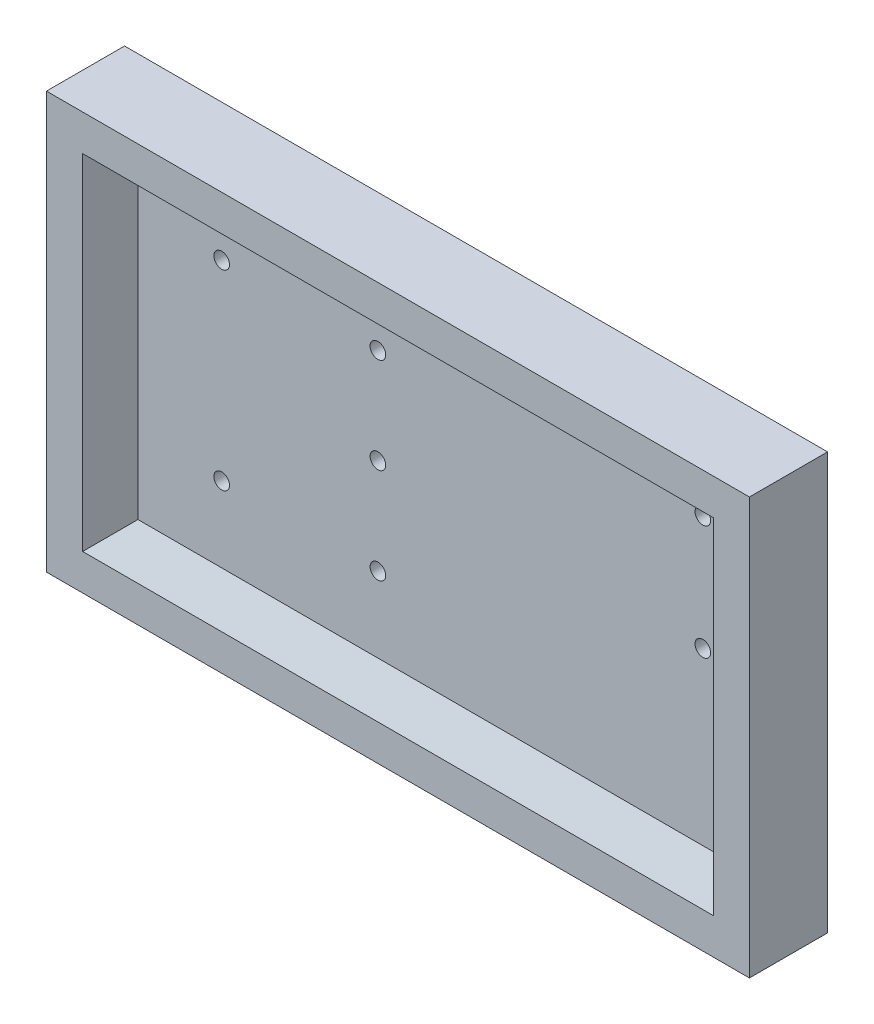
ISO-10303-21;
HEADER;
FILE_DESCRIPTION(('STEP AP214'),'2;1');
FILE_NAME('part.step','',(''),(''),'','','');
FILE_SCHEMA(('AUTOMOTIVE_DESIGN { 1 0 10303 214 1 1 1 1 }'));
ENDSEC;
DATA;
#1=APPLICATION_CONTEXT('core data for automotive mechanical design processes');
#2=APPLICATION_PROTOCOL_DEFINITION('international standard','automotive_design',2000,#1);
#3=PRODUCT_CONTEXT('',#1,'mechanical');
#4=PRODUCT('Part','Part','',(#3));
#5=PRODUCT_RELATED_PRODUCT_CATEGORY('part','',(#4));
#6=PRODUCT_DEFINITION_FORMATION('','',#4);
#7=PRODUCT_DEFINITION_CONTEXT('part definition',#1,'design');
#8=PRODUCT_DEFINITION('design','',#6,#7);
#9=PRODUCT_DEFINITION_SHAPE('','',#8);
#10=(LENGTH_UNIT() NAMED_UNIT(*) SI_UNIT(.MILLI.,.METRE.));
#11=(NAMED_UNIT(*) PLANE_ANGLE_UNIT() SI_UNIT($,.RADIAN.));
#12=(NAMED_UNIT(*) SI_UNIT($,.STERADIAN.) SOLID_ANGLE_UNIT());
#13=UNCERTAINTY_MEASURE_WITH_UNIT(LENGTH_MEASURE(1.E-05),#10,'distance_accuracy_value','');
#14=(GEOMETRIC_REPRESENTATION_CONTEXT(3) GLOBAL_UNCERTAINTY_ASSIGNED_CONTEXT((#13)) GLOBAL_UNIT_ASSIGNED_CONTEXT((#10,
#11,#12)) REPRESENTATION_CONTEXT('',''));
#15=CARTESIAN_POINT('',(0.,0.,0.));
#16=DIRECTION('',(0.,0.,1.));
#17=DIRECTION('',(1.,0.,0.));
#18=AXIS2_PLACEMENT_3D('',#15,#16,#17);
#19=CARTESIAN_POINT('',(53.3,40.,-30.));
#20=DIRECTION('',(0.,0.,-1.));
#21=DIRECTION('',(-1.,0.,0.));
#22=AXIS2_PLACEMENT_3D('',#19,#20,#21);
#23=CYLINDRICAL_SURFACE('',#22,1.5);
#24=CARTESIAN_POINT('',(53.3,40.,-40.));
#25=DIRECTION('',(0.,0.,-1.));
#26=DIRECTION('',(-1.,0.,0.));
#27=AXIS2_PLACEMENT_3D('',#24,#25,#26);
#28=CIRCLE('',#27,1.5);
#29=CARTESIAN_POINT('',(51.8,40.,-40.));
#30=VERTEX_POINT('',#29);
#31=EDGE_CURVE('E180',#30,#30,#28,.T.);
#32=ORIENTED_EDGE('',*,*,#31,.T.);
#33=EDGE_LOOP('',(#32));
#34=FACE_BOUND('',#33,.T.);
#35=CARTESIAN_POINT('',(53.3,40.,-35.35));
#36=DIRECTION('',(0.,0.,1.));
#37=DIRECTION('',(1.,0.,0.));
#38=AXIS2_PLACEMENT_3D('',#35,#36,#37);
#39=CIRCLE('',#38,1.5);
#40=CARTESIAN_POINT('',(54.8,40.,-35.35));
#41=VERTEX_POINT('',#40);
#42=EDGE_CURVE('E173',#41,#41,#39,.F.);
#43=ORIENTED_EDGE('',*,*,#42,.F.);
#44=EDGE_LOOP('',(#43));
#45=FACE_BOUND('',#44,.T.);
#46=ADVANCED_FACE('F33',(#34,#45),#23,.F.);
#47=CARTESIAN_POINT('',(53.3,58.35,-30.));
#48=DIRECTION('',(0.,0.,-1.));
#49=DIRECTION('',(-1.,0.,0.));
#50=AXIS2_PLACEMENT_3D('',#47,#48,#49);
#51=CYLINDRICAL_SURFACE('',#50,1.5);
#52=CARTESIAN_POINT('',(53.3,58.35,-40.));
#53=DIRECTION('',(0.,0.,-1.));
#54=DIRECTION('',(-1.,0.,0.));
#55=AXIS2_PLACEMENT_3D('',#52,#53,#54);
#56=CIRCLE('',#55,1.5);
#57=CARTESIAN_POINT('',(51.8,58.35,-40.));
#58=VERTEX_POINT('',#57);
#59=EDGE_CURVE('E177',#58,#58,#56,.T.);
#60=ORIENTED_EDGE('',*,*,#59,.T.);
#61=EDGE_LOOP('',(#60));
#62=FACE_BOUND('',#61,.T.);
#63=CARTESIAN_POINT('',(53.3,58.35,-35.35));
#64=DIRECTION('',(0.,0.,1.));
#65=DIRECTION('',(1.,0.,0.));
#66=AXIS2_PLACEMENT_3D('',#63,#64,#65);
#67=CIRCLE('',#66,1.5);
#68=CARTESIAN_POINT('',(54.8,58.35,-35.35));
#69=VERTEX_POINT('',#68);
#70=EDGE_CURVE('E170',#69,#69,#67,.F.);
#71=ORIENTED_EDGE('',*,*,#70,.F.);
#72=EDGE_LOOP('',(#71));
#73=FACE_BOUND('',#72,.T.);
#74=ADVANCED_FACE('F235',(#62,#73),#51,.F.);
#75=CARTESIAN_POINT('',(53.3,21.65,-30.));
#76=DIRECTION('',(0.,0.,-1.));
#77=DIRECTION('',(-1.,0.,0.));
#78=AXIS2_PLACEMENT_3D('',#75,#76,#77);
#79=CYLINDRICAL_SURFACE('',#78,1.5);
#80=CARTESIAN_POINT('',(53.3,21.65,-40.));
#81=DIRECTION('',(0.,0.,-1.));
#82=DIRECTION('',(-1.,0.,0.));
#83=AXIS2_PLACEMENT_3D('',#80,#81,#82);
#84=CIRCLE('',#83,1.5);
#85=CARTESIAN_POINT('',(51.8,21.65,-40.));
#86=VERTEX_POINT('',#85);
#87=EDGE_CURVE('E181',#86,#86,#84,.T.);
#88=ORIENTED_EDGE('',*,*,#87,.T.);
#89=EDGE_LOOP('',(#88));
#90=FACE_BOUND('',#89,.T.);
#91=CARTESIAN_POINT('',(53.3,21.65,-35.35));
#92=DIRECTION('',(0.,0.,1.));
#93=DIRECTION('',(1.,0.,0.));
#94=AXIS2_PLACEMENT_3D('',#91,#92,#93);
#95=CIRCLE('',#94,1.5);
#96=CARTESIAN_POINT('',(54.8,21.65,-35.35));
#97=VERTEX_POINT('',#96);
#98=EDGE_CURVE('E167',#97,#97,#95,.F.);
#99=ORIENTED_EDGE('',*,*,#98,.F.);
#100=EDGE_LOOP('',(#99));
#101=FACE_BOUND('',#100,.T.);
#102=ADVANCED_FACE('F241',(#90,#101),#79,.F.);
#103=CARTESIAN_POINT('',(23.3,58.35,-30.));
#104=DIRECTION('',(0.,0.,-1.));
#105=DIRECTION('',(-1.,0.,0.));
#106=AXIS2_PLACEMENT_3D('',#103,#104,#105);
#107=CYLINDRICAL_SURFACE('',#106,1.5);
#108=CARTESIAN_POINT('',(23.3,58.35,-40.));
#109=DIRECTION('',(0.,0.,-1.));
#110=DIRECTION('',(-1.,0.,0.));
#111=AXIS2_PLACEMENT_3D('',#108,#109,#110);
#112=CIRCLE('',#111,1.5);
#113=CARTESIAN_POINT('',(21.8,58.35,-40.));
#114=VERTEX_POINT('',#113);
#115=EDGE_CURVE('E184',#114,#114,#112,.T.);
#116=ORIENTED_EDGE('',*,*,#115,.T.);
#117=EDGE_LOOP('',(#116));
#118=FACE_BOUND('',#117,.T.);
#119=CARTESIAN_POINT('',(23.3,58.35,-35.35));
#120=DIRECTION('',(0.,0.,1.));
#121=DIRECTION('',(1.,0.,0.));
#122=AXIS2_PLACEMENT_3D('',#119,#120,#121);
#123=CIRCLE('',#122,1.5);
#124=CARTESIAN_POINT('',(24.8,58.35,-35.35));
#125=VERTEX_POINT('',#124);
#126=EDGE_CURVE('E164',#125,#125,#123,.F.);
#127=ORIENTED_EDGE('',*,*,#126,.F.);
#128=EDGE_LOOP('',(#127));
#129=FACE_BOUND('',#128,.T.);
#130=ADVANCED_FACE('F325',(#118,#129),#107,.F.);
#131=CARTESIAN_POINT('',(23.3,21.65,-30.));
#132=DIRECTION('',(0.,0.,-1.));
#133=DIRECTION('',(-1.,0.,0.));
#134=AXIS2_PLACEMENT_3D('',#131,#132,#133);
#135=CYLINDRICAL_SURFACE('',#134,1.5);
#136=CARTESIAN_POINT('',(23.3,21.65,-40.));
#137=DIRECTION('',(0.,0.,-1.));
#138=DIRECTION('',(-1.,0.,0.));
#139=AXIS2_PLACEMENT_3D('',#136,#137,#138);
#140=CIRCLE('',#139,1.5);
#141=CARTESIAN_POINT('',(21.8,21.65,-40.));
#142=VERTEX_POINT('',#141);
#143=EDGE_CURVE('E187',#142,#142,#140,.T.);
#144=ORIENTED_EDGE('',*,*,#143,.T.);
#145=EDGE_LOOP('',(#144));
#146=FACE_BOUND('',#145,.T.);
#147=CARTESIAN_POINT('',(23.3,21.65,-35.35));
#148=DIRECTION('',(0.,0.,1.));
#149=DIRECTION('',(1.,0.,0.));
#150=AXIS2_PLACEMENT_3D('',#147,#148,#149);
#151=CIRCLE('',#150,1.5);
#152=CARTESIAN_POINT('',(24.8,21.65,-35.35));
#153=VERTEX_POINT('',#152);
#154=EDGE_CURVE('E131',#153,#153,#151,.F.);
#155=ORIENTED_EDGE('',*,*,#154,.F.);
#156=EDGE_LOOP('',(#155));
#157=FACE_BOUND('',#156,.T.);
#158=ADVANCED_FACE('F334',(#146,#157),#135,.F.);
#159=CARTESIAN_POINT('',(115.7,40.,-30.));
#160=DIRECTION('',(0.,0.,-1.));
#161=DIRECTION('',(-1.,0.,0.));
#162=AXIS2_PLACEMENT_3D('',#159,#160,#161);
#163=CYLINDRICAL_SURFACE('',#162,1.5);
#164=CARTESIAN_POINT('',(115.7,40.,-40.));
#165=DIRECTION('',(0.,0.,-1.));
#166=DIRECTION('',(-1.,0.,0.));
#167=AXIS2_PLACEMENT_3D('',#164,#165,#166);
#168=CIRCLE('',#167,1.5);
#169=CARTESIAN_POINT('',(114.2,40.,-40.));
#170=VERTEX_POINT('',#169);
#171=EDGE_CURVE('E190',#170,#170,#168,.T.);
#172=ORIENTED_EDGE('',*,*,#171,.T.);
#173=EDGE_LOOP('',(#172));
#174=FACE_BOUND('',#173,.T.);
#175=CARTESIAN_POINT('',(115.7,40.,-35.35));
#176=DIRECTION('',(0.,0.,1.));
#177=DIRECTION('',(1.,0.,0.));
#178=AXIS2_PLACEMENT_3D('',#175,#176,#177);
#179=CIRCLE('',#178,1.5);
#180=CARTESIAN_POINT('',(117.2,40.,-35.35));
#181=VERTEX_POINT('',#180);
#182=EDGE_CURVE('E126',#181,#181,#179,.F.);
#183=ORIENTED_EDGE('',*,*,#182,.F.);
#184=EDGE_LOOP('',(#183));
#185=FACE_BOUND('',#184,.T.);
#186=ADVANCED_FACE('F343',(#174,#185),#163,.F.);
#187=CARTESIAN_POINT('',(115.7,62.,-30.));
#188=DIRECTION('',(0.,0.,-1.));
#189=DIRECTION('',(-1.,0.,0.));
#190=AXIS2_PLACEMENT_3D('',#187,#188,#189);
#191=CYLINDRICAL_SURFACE('',#190,1.5);
#192=CARTESIAN_POINT('',(115.7,62.,-40.));
#193=DIRECTION('',(0.,0.,-1.));
#194=DIRECTION('',(-1.,0.,0.));
#195=AXIS2_PLACEMENT_3D('',#192,#193,#194);
#196=CIRCLE('',#195,1.5);
#197=CARTESIAN_POINT('',(114.2,62.,-40.));
#198=VERTEX_POINT('',#197);
#199=EDGE_CURVE('E176',#198,#198,#196,.T.);
#200=ORIENTED_EDGE('',*,*,#199,.T.);
#201=EDGE_LOOP('',(#200));
#202=FACE_BOUND('',#201,.T.);
#203=CARTESIAN_POINT('',(115.7,62.,-35.35));
#204=DIRECTION('',(0.,0.,1.));
#205=DIRECTION('',(1.,0.,0.));
#206=AXIS2_PLACEMENT_3D('',#203,#204,#205);
#207=CIRCLE('',#206,1.5);
#208=CARTESIAN_POINT('',(117.2,62.,-35.35));
#209=VERTEX_POINT('',#208);
#210=EDGE_CURVE('E124',#209,#209,#207,.F.);
#211=ORIENTED_EDGE('',*,*,#210,.F.);
#212=EDGE_LOOP('',(#211));
#213=FACE_BOUND('',#212,.T.);
#214=ADVANCED_FACE('F247',(#202,#213),#191,.F.);
#215=CARTESIAN_POINT('',(0.,0.,-40.));
#216=DIRECTION('',(-1.,0.,0.));
#217=DIRECTION('',(0.,0.,1.));
#218=AXIS2_PLACEMENT_3D('',#215,#216,#217);
#219=PLANE('',#218);
#220=DIRECTION('',(0.,1.,0.));
#221=VECTOR('',#220,1.);
#222=CARTESIAN_POINT('',(0.,-20.,-25.));
#223=LINE('',#222,#221);
#224=CARTESIAN_POINT('',(0.,0.,-25.));
#225=VERTEX_POINT('',#224);
#226=CARTESIAN_POINT('',(0.,80.,-25.));
#227=VERTEX_POINT('',#226);
#228=EDGE_CURVE('E48',#225,#227,#223,.T.);
#229=ORIENTED_EDGE('',*,*,#228,.T.);
#230=DIRECTION('',(0.,0.,1.));
#231=VECTOR('',#230,1.);
#232=CARTESIAN_POINT('',(0.,80.,-40.));
#233=LINE('',#232,#231);
#234=CARTESIAN_POINT('',(0.,80.,-40.));
#235=VERTEX_POINT('',#234);
#236=EDGE_CURVE('E41',#235,#227,#233,.T.);
#237=ORIENTED_EDGE('',*,*,#236,.F.);
#238=DIRECTION('',(0.,-1.,0.));
#239=VECTOR('',#238,1.);
#240=CARTESIAN_POINT('',(0.,0.,-40.));
#241=LINE('',#240,#239);
#242=CARTESIAN_POINT('',(0.,0.,-40.));
#243=VERTEX_POINT('',#242);
#244=EDGE_CURVE('E197',#235,#243,#241,.T.);
#245=ORIENTED_EDGE('',*,*,#244,.T.);
#246=DIRECTION('',(0.,0.,1.));
#247=VECTOR('',#246,1.);
#248=CARTESIAN_POINT('',(0.,0.,-40.));
#249=LINE('',#248,#247);
#250=EDGE_CURVE('E118',#243,#225,#249,.T.);
#251=ORIENTED_EDGE('',*,*,#250,.T.);
#252=EDGE_LOOP('',(#229,#237,#245,#251));
#253=FACE_BOUND('',#252,.T.);
#254=ADVANCED_FACE('F35',(#253),#219,.T.);
#255=CARTESIAN_POINT('',(0.,80.,-40.));
#256=DIRECTION('',(0.,1.,0.));
#257=DIRECTION('',(0.,0.,1.));
#258=AXIS2_PLACEMENT_3D('',#255,#256,#257);
#259=PLANE('',#258);
#260=DIRECTION('',(-1.,0.,0.));
#261=VECTOR('',#260,1.);
#262=CARTESIAN_POINT('',(0.,80.,-25.));
#263=LINE('',#262,#261);
#264=CARTESIAN_POINT('',(135.,80.,-25.));
#265=VERTEX_POINT('',#264);
#266=EDGE_CURVE('E98',#265,#227,#263,.T.);
#267=ORIENTED_EDGE('',*,*,#266,.F.);
#268=DIRECTION('',(0.,0.,1.));
#269=VECTOR('',#268,1.);
#270=CARTESIAN_POINT('',(135.,80.,-40.));
#271=LINE('',#270,#269);
#272=CARTESIAN_POINT('',(135.,80.,-40.));
#273=VERTEX_POINT('',#272);
#274=EDGE_CURVE('E108',#273,#265,#271,.T.);
#275=ORIENTED_EDGE('',*,*,#274,.F.);
#276=DIRECTION('',(-1.,0.,0.));
#277=VECTOR('',#276,1.);
#278=CARTESIAN_POINT('',(0.,80.,-40.));
#279=LINE('',#278,#277);
#280=EDGE_CURVE('E123',#273,#235,#279,.T.);
#281=ORIENTED_EDGE('',*,*,#280,.T.);
#282=ORIENTED_EDGE('',*,*,#236,.T.);
#283=EDGE_LOOP('',(#267,#275,#281,#282));
#284=FACE_BOUND('',#283,.T.);
#285=ADVANCED_FACE('F106',(#284),#259,.T.);
#286=CARTESIAN_POINT('',(135.,0.,-40.));
#287=DIRECTION('',(1.,0.,0.));
#288=DIRECTION('',(0.,0.,-1.));
#289=AXIS2_PLACEMENT_3D('',#286,#287,#288);
#290=PLANE('',#289);
#291=DIRECTION('',(0.,1.,0.));
#292=VECTOR('',#291,1.);
#293=CARTESIAN_POINT('',(135.,-20.,-25.));
#294=LINE('',#293,#292);
#295=CARTESIAN_POINT('',(135.,0.,-25.));
#296=VERTEX_POINT('',#295);
#297=EDGE_CURVE('E95',#296,#265,#294,.T.);
#298=ORIENTED_EDGE('',*,*,#297,.F.);
#299=DIRECTION('',(0.,0.,1.));
#300=VECTOR('',#299,1.);
#301=CARTESIAN_POINT('',(135.,0.,-40.));
#302=LINE('',#301,#300);
#303=CARTESIAN_POINT('',(135.,0.,-40.));
#304=VERTEX_POINT('',#303);
#305=EDGE_CURVE('E115',#304,#296,#302,.T.);
#306=ORIENTED_EDGE('',*,*,#305,.F.);
#307=DIRECTION('',(0.,1.,0.));
#308=VECTOR('',#307,1.);
#309=CARTESIAN_POINT('',(135.,0.,-40.));
#310=LINE('',#309,#308);
#311=EDGE_CURVE('E113',#304,#273,#310,.T.);
#312=ORIENTED_EDGE('',*,*,#311,.T.);
#313=ORIENTED_EDGE('',*,*,#274,.T.);
#314=EDGE_LOOP('',(#298,#306,#312,#313));
#315=FACE_BOUND('',#314,.T.);
#316=ADVANCED_FACE('F111',(#315),#290,.T.);
#317=CARTESIAN_POINT('',(0.,0.,-40.));
#318=DIRECTION('',(0.,-1.,0.));
#319=DIRECTION('',(0.,0.,-1.));
#320=AXIS2_PLACEMENT_3D('',#317,#318,#319);
#321=PLANE('',#320);
#322=DIRECTION('',(1.,0.,0.));
#323=VECTOR('',#322,1.);
#324=CARTESIAN_POINT('',(0.,0.,-25.));
#325=LINE('',#324,#323);
#326=EDGE_CURVE('E99',#225,#296,#325,.T.);
#327=ORIENTED_EDGE('',*,*,#326,.F.);
#328=ORIENTED_EDGE('',*,*,#250,.F.);
#329=DIRECTION('',(1.,0.,0.));
#330=VECTOR('',#329,1.);
#331=CARTESIAN_POINT('',(0.,0.,-40.));
#332=LINE('',#331,#330);
#333=EDGE_CURVE('E200',#243,#304,#332,.T.);
#334=ORIENTED_EDGE('',*,*,#333,.T.);
#335=ORIENTED_EDGE('',*,*,#305,.T.);
#336=EDGE_LOOP('',(#327,#328,#334,#335));
#337=FACE_BOUND('',#336,.T.);
#338=ADVANCED_FACE('F251',(#337),#321,.T.);
#339=CARTESIAN_POINT('',(0.,0.,-40.));
#340=DIRECTION('',(0.,0.,-1.));
#341=DIRECTION('',(-1.,0.,0.));
#342=AXIS2_PLACEMENT_3D('',#339,#340,#341);
#343=PLANE('',#342);
#344=ORIENTED_EDGE('',*,*,#199,.F.);
#345=EDGE_LOOP('',(#344));
#346=FACE_BOUND('',#345,.T.);
#347=ORIENTED_EDGE('',*,*,#171,.F.);
#348=EDGE_LOOP('',(#347));
#349=FACE_BOUND('',#348,.T.);
#350=ORIENTED_EDGE('',*,*,#143,.F.);
#351=EDGE_LOOP('',(#350));
#352=FACE_BOUND('',#351,.T.);
#353=ORIENTED_EDGE('',*,*,#115,.F.);
#354=EDGE_LOOP('',(#353));
#355=FACE_BOUND('',#354,.T.);
#356=ORIENTED_EDGE('',*,*,#87,.F.);
#357=EDGE_LOOP('',(#356));
#358=FACE_BOUND('',#357,.T.);
#359=ORIENTED_EDGE('',*,*,#59,.F.);
#360=EDGE_LOOP('',(#359));
#361=FACE_BOUND('',#360,.T.);
#362=ORIENTED_EDGE('',*,*,#31,.F.);
#363=EDGE_LOOP('',(#362));
#364=FACE_BOUND('',#363,.T.);
#365=ORIENTED_EDGE('',*,*,#244,.F.);
#366=ORIENTED_EDGE('',*,*,#280,.F.);
#367=ORIENTED_EDGE('',*,*,#311,.F.);
#368=ORIENTED_EDGE('',*,*,#333,.F.);
#369=EDGE_LOOP('',(#365,#366,#367,#368));
#370=FACE_BOUND('',#369,.T.);
#371=ADVANCED_FACE('F205',(#346,#349,#352,#355,#358,#361,#364,#370),#343,.T.);
#372=CARTESIAN_POINT('',(67.5,40.,-35.35));
#373=DIRECTION('',(0.,0.,1.));
#374=DIRECTION('',(1.,0.,0.));
#375=AXIS2_PLACEMENT_3D('',#372,#373,#374);
#376=PLANE('',#375);
#377=DIRECTION('',(0.,1.,0.));
#378=VECTOR('',#377,1.);
#379=CARTESIAN_POINT('',(127.780327672529,40.,-35.35));
#380=LINE('',#379,#378);
#381=CARTESIAN_POINT('',(127.780327672529,7.18150486374522,-35.35));
#382=VERTEX_POINT('',#381);
#383=CARTESIAN_POINT('',(127.780327672529,72.8184951362548,-35.35));
#384=VERTEX_POINT('',#383);
#385=EDGE_CURVE('E145',#382,#384,#380,.T.);
#386=ORIENTED_EDGE('',*,*,#385,.T.);
#387=DIRECTION('',(-1.,0.,0.));
#388=VECTOR('',#387,1.);
#389=CARTESIAN_POINT('',(67.5,72.8184951362548,-35.35));
#390=LINE('',#389,#388);
#391=CARTESIAN_POINT('',(7.21967232747066,72.8184951362548,-35.35));
#392=VERTEX_POINT('',#391);
#393=EDGE_CURVE('E148',#384,#392,#390,.T.);
#394=ORIENTED_EDGE('',*,*,#393,.T.);
#395=DIRECTION('',(0.,-1.,0.));
#396=VECTOR('',#395,1.);
#397=CARTESIAN_POINT('',(7.21967232747067,40.,-35.35));
#398=LINE('',#397,#396);
#399=CARTESIAN_POINT('',(7.21967232747068,7.18150486374522,-35.35));
#400=VERTEX_POINT('',#399);
#401=EDGE_CURVE('E155',#392,#400,#398,.T.);
#402=ORIENTED_EDGE('',*,*,#401,.T.);
#403=DIRECTION('',(1.,0.,0.));
#404=VECTOR('',#403,1.);
#405=CARTESIAN_POINT('',(67.5,7.18150486374522,-35.35));
#406=LINE('',#405,#404);
#407=EDGE_CURVE('E151',#400,#382,#406,.T.);
#408=ORIENTED_EDGE('',*,*,#407,.T.);
#409=EDGE_LOOP('',(#386,#394,#402,#408));
#410=FACE_BOUND('',#409,.T.);
#411=ORIENTED_EDGE('',*,*,#210,.T.);
#412=EDGE_LOOP('',(#411));
#413=FACE_BOUND('',#412,.T.);
#414=ORIENTED_EDGE('',*,*,#182,.T.);
#415=EDGE_LOOP('',(#414));
#416=FACE_BOUND('',#415,.T.);
#417=ORIENTED_EDGE('',*,*,#154,.T.);
#418=EDGE_LOOP('',(#417));
#419=FACE_BOUND('',#418,.T.);
#420=ORIENTED_EDGE('',*,*,#126,.T.);
#421=EDGE_LOOP('',(#420));
#422=FACE_BOUND('',#421,.T.);
#423=ORIENTED_EDGE('',*,*,#98,.T.);
#424=EDGE_LOOP('',(#423));
#425=FACE_BOUND('',#424,.T.);
#426=ORIENTED_EDGE('',*,*,#70,.T.);
#427=EDGE_LOOP('',(#426));
#428=FACE_BOUND('',#427,.T.);
#429=ORIENTED_EDGE('',*,*,#42,.T.);
#430=EDGE_LOOP('',(#429));
#431=FACE_BOUND('',#430,.T.);
#432=ADVANCED_FACE('F220',(#410,#413,#416,#419,#422,#425,#428,#431),#376,.T.);
#433=CARTESIAN_POINT('',(128.706,6.25124999999999,0.));
#434=DIRECTION('',(0.999657324975557,0.,-0.0261769483078695));
#435=DIRECTION('',(-0.0261769483078695,0.,-0.999657324975558));
#436=AXIS2_PLACEMENT_3D('',#433,#434,#435);
#437=PLANE('',#436);
#438=DIRECTION('',(0.0261678953385402,-0.0262974393748696,0.999311606024806));
#439=VECTOR('',#438,1.);
#440=CARTESIAN_POINT('',(128.622176742619,6.33548822400172,-3.20108105263996));
#441=LINE('',#440,#439);
#442=CARTESIAN_POINT('',(128.05135196077,6.90913887110695,-25.));
#443=VERTEX_POINT('',#442);
#444=EDGE_CURVE('E127',#382,#443,#441,.T.);
#445=ORIENTED_EDGE('',*,*,#444,.T.);
#446=DIRECTION('',(0.,1.,0.));
#447=VECTOR('',#446,1.);
#448=CARTESIAN_POINT('',(128.05135196077,6.25124999999999,-25.));
#449=LINE('',#448,#447);
#450=CARTESIAN_POINT('',(128.05135196077,73.090861128893,-25.));
#451=VERTEX_POINT('',#450);
#452=EDGE_CURVE('E213',#443,#451,#449,.T.);
#453=ORIENTED_EDGE('',*,*,#452,.T.);
#454=DIRECTION('',(0.0261678953385402,0.0262974393748696,0.999311606024806));
#455=VECTOR('',#454,1.);
#456=CARTESIAN_POINT('',(128.660007866206,73.7025301823753,-1.75636872937754));
#457=LINE('',#456,#455);
#458=EDGE_CURVE('E149',#384,#451,#457,.T.);
#459=ORIENTED_EDGE('',*,*,#458,.F.);
#460=ORIENTED_EDGE('',*,*,#385,.F.);
#461=EDGE_LOOP('',(#445,#453,#459,#460));
#462=FACE_BOUND('',#461,.T.);
#463=ADVANCED_FACE('F214',(#462),#437,.F.);
#464=CARTESIAN_POINT('',(6.29400000000005,6.25124999999999,0.));
#465=DIRECTION('',(0.,-0.99965392552087,-0.0263064477023425));
#466=DIRECTION('',(0.,0.0263064477023425,-0.999653925520869));
#467=AXIS2_PLACEMENT_3D('',#464,#465,#466);
#468=PLANE('',#467);
#469=DIRECTION('',(-0.0261678953385402,-0.0262974393748696,0.999311606024806));
#470=VECTOR('',#469,1.);
#471=CARTESIAN_POINT('',(6.3399921337941,6.2974698176247,-1.75636872937753));
#472=LINE('',#471,#470);
#473=CARTESIAN_POINT('',(6.94864803922963,6.90913887110695,-25.));
#474=VERTEX_POINT('',#473);
#475=EDGE_CURVE('E134',#400,#474,#472,.T.);
#476=ORIENTED_EDGE('',*,*,#475,.T.);
#477=DIRECTION('',(1.,0.,0.));
#478=VECTOR('',#477,1.);
#479=CARTESIAN_POINT('',(6.29400000000005,6.90913887110694,-25.));
#480=LINE('',#479,#478);
#481=EDGE_CURVE('E209',#474,#443,#480,.T.);
#482=ORIENTED_EDGE('',*,*,#481,.T.);
#483=ORIENTED_EDGE('',*,*,#444,.F.);
#484=ORIENTED_EDGE('',*,*,#407,.F.);
#485=EDGE_LOOP('',(#476,#482,#483,#484));
#486=FACE_BOUND('',#485,.T.);
#487=ADVANCED_FACE('F223',(#486),#468,.F.);
#488=CARTESIAN_POINT('',(6.29400000000004,73.74875,0.));
#489=DIRECTION('',(-0.999657324975557,0.,-0.0261769483078695));
#490=DIRECTION('',(-0.0261769483078695,0.,0.999657324975558));
#491=AXIS2_PLACEMENT_3D('',#488,#489,#490);
#492=PLANE('',#491);
#493=DIRECTION('',(-0.0261678953385402,0.0262974393748696,0.999311606024806));
#494=VECTOR('',#493,1.);
#495=CARTESIAN_POINT('',(6.37782325738107,73.6645117759982,-3.20108105263996));
#496=LINE('',#495,#494);
#497=CARTESIAN_POINT('',(6.94864803922962,73.090861128893,-25.));
#498=VERTEX_POINT('',#497);
#499=EDGE_CURVE('E140',#392,#498,#496,.T.);
#500=ORIENTED_EDGE('',*,*,#499,.T.);
#501=DIRECTION('',(0.,-1.,0.));
#502=VECTOR('',#501,1.);
#503=CARTESIAN_POINT('',(6.94864803922962,73.74875,-25.));
#504=LINE('',#503,#502);
#505=EDGE_CURVE('E56',#498,#474,#504,.T.);
#506=ORIENTED_EDGE('',*,*,#505,.T.);
#507=ORIENTED_EDGE('',*,*,#475,.F.);
#508=ORIENTED_EDGE('',*,*,#401,.F.);
#509=EDGE_LOOP('',(#500,#506,#507,#508));
#510=FACE_BOUND('',#509,.T.);
#511=ADVANCED_FACE('F225',(#510),#492,.F.);
#512=CARTESIAN_POINT('',(128.706,73.74875,0.));
#513=DIRECTION('',(0.,0.99965392552087,-0.0263064477023425));
#514=DIRECTION('',(0.,0.0263064477023425,0.999653925520869));
#515=AXIS2_PLACEMENT_3D('',#512,#513,#514);
#516=PLANE('',#515);
#517=ORIENTED_EDGE('',*,*,#458,.T.);
#518=DIRECTION('',(-1.,0.,0.));
#519=VECTOR('',#518,1.);
#520=CARTESIAN_POINT('',(128.706,73.090861128893,-25.));
#521=LINE('',#520,#519);
#522=EDGE_CURVE('E11',#451,#498,#521,.T.);
#523=ORIENTED_EDGE('',*,*,#522,.T.);
#524=ORIENTED_EDGE('',*,*,#499,.F.);
#525=ORIENTED_EDGE('',*,*,#393,.F.);
#526=EDGE_LOOP('',(#517,#523,#524,#525));
#527=FACE_BOUND('',#526,.T.);
#528=ADVANCED_FACE('F217',(#527),#516,.F.);
#529=CARTESIAN_POINT('',(0.,-20.,-25.));
#530=DIRECTION('',(0.,0.,-1.));
#531=DIRECTION('',(-1.,0.,0.));
#532=AXIS2_PLACEMENT_3D('',#529,#530,#531);
#533=PLANE('',#532);
#534=ORIENTED_EDGE('',*,*,#326,.T.);
#535=ORIENTED_EDGE('',*,*,#297,.T.);
#536=ORIENTED_EDGE('',*,*,#266,.T.);
#537=ORIENTED_EDGE('',*,*,#228,.F.);
#538=EDGE_LOOP('',(#534,#535,#536,#537));
#539=FACE_BOUND('',#538,.T.);
#540=ORIENTED_EDGE('',*,*,#481,.F.);
#541=ORIENTED_EDGE('',*,*,#505,.F.);
#542=ORIENTED_EDGE('',*,*,#522,.F.);
#543=ORIENTED_EDGE('',*,*,#452,.F.);
#544=EDGE_LOOP('',(#540,#541,#542,#543));
#545=FACE_BOUND('',#544,.T.);
#546=ADVANCED_FACE('F97',(#539,#545),#533,.F.);
#547=CLOSED_SHELL('',(#46,#74,#102,#130,#158,#186,#214,#254,#285,#316,#338,#371,#432,#463,#487,
#511,#528,#546));
#548=MANIFOLD_SOLID_BREP('B2',#547);
#549=ADVANCED_BREP_SHAPE_REPRESENTATION('',(#18,#548),#14);
#550=SHAPE_DEFINITION_REPRESENTATION(#9,#549);
ENDSEC;
END-ISO-10303-21;
